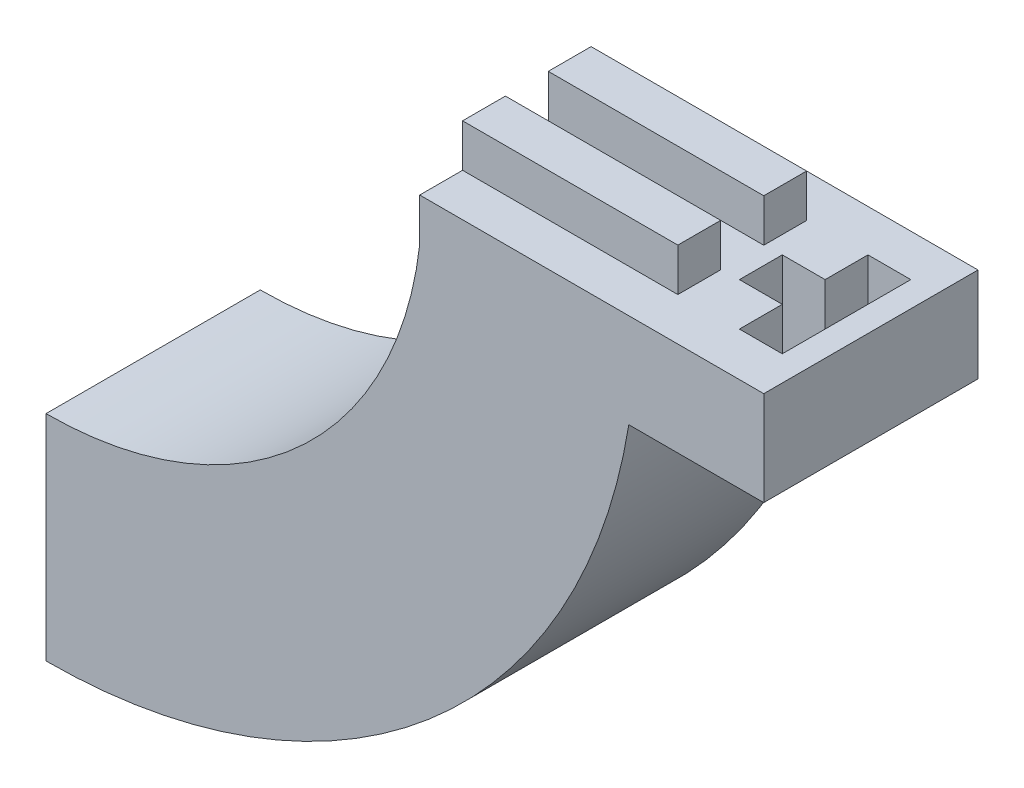
ISO-10303-21;
HEADER;
FILE_DESCRIPTION(('STEP AP214'),'2;1');
FILE_NAME('part.step','',(''),(''),'','','');
FILE_SCHEMA(('AUTOMOTIVE_DESIGN { 1 0 10303 214 1 1 1 1 }'));
ENDSEC;
DATA;
#1=APPLICATION_CONTEXT('core data for automotive mechanical design processes');
#2=APPLICATION_PROTOCOL_DEFINITION('international standard','automotive_design',2000,#1);
#3=PRODUCT_CONTEXT('',#1,'mechanical');
#4=PRODUCT('Part','Part','',(#3));
#5=PRODUCT_RELATED_PRODUCT_CATEGORY('part','',(#4));
#6=PRODUCT_DEFINITION_FORMATION('','',#4);
#7=PRODUCT_DEFINITION_CONTEXT('part definition',#1,'design');
#8=PRODUCT_DEFINITION('design','',#6,#7);
#9=PRODUCT_DEFINITION_SHAPE('','',#8);
#10=(LENGTH_UNIT() NAMED_UNIT(*) SI_UNIT(.MILLI.,.METRE.));
#11=(NAMED_UNIT(*) PLANE_ANGLE_UNIT() SI_UNIT($,.RADIAN.));
#12=(NAMED_UNIT(*) SI_UNIT($,.STERADIAN.) SOLID_ANGLE_UNIT());
#13=UNCERTAINTY_MEASURE_WITH_UNIT(LENGTH_MEASURE(1.E-05),#10,'distance_accuracy_value','');
#14=(GEOMETRIC_REPRESENTATION_CONTEXT(3) GLOBAL_UNCERTAINTY_ASSIGNED_CONTEXT((#13)) GLOBAL_UNIT_ASSIGNED_CONTEXT((#10,
#11,#12)) REPRESENTATION_CONTEXT('',''));
#15=CARTESIAN_POINT('',(0.,0.,0.));
#16=DIRECTION('',(0.,0.,1.));
#17=DIRECTION('',(1.,0.,0.));
#18=AXIS2_PLACEMENT_3D('',#15,#16,#17);
#19=CARTESIAN_POINT('',(0.,0.,0.));
#20=DIRECTION('',(0.,-1.,0.));
#21=DIRECTION('',(0.,0.,-1.));
#22=AXIS2_PLACEMENT_3D('',#19,#20,#21);
#23=PLANE('',#22);
#24=DIRECTION('',(-1.,0.,0.));
#25=VECTOR('',#24,1.);
#26=CARTESIAN_POINT('',(22.1548730531231,0.,0.));
#27=LINE('',#26,#25);
#28=CARTESIAN_POINT('',(42.5505771587127,0.,0.));
#29=VERTEX_POINT('',#28);
#30=CARTESIAN_POINT('',(22.1548730531231,0.,0.));
#31=VERTEX_POINT('',#30);
#32=EDGE_CURVE('E345',#29,#31,#27,.T.);
#33=ORIENTED_EDGE('',*,*,#32,.T.);
#34=DIRECTION('',(0.,0.,1.));
#35=VECTOR('',#34,1.);
#36=CARTESIAN_POINT('',(22.1548730531231,0.,0.));
#37=LINE('',#36,#35);
#38=CARTESIAN_POINT('',(22.1548730531231,0.,2.54));
#39=VERTEX_POINT('',#38);
#40=EDGE_CURVE('E348',#31,#39,#37,.T.);
#41=ORIENTED_EDGE('',*,*,#40,.T.);
#42=DIRECTION('',(-1.,0.,0.));
#43=VECTOR('',#42,1.);
#44=CARTESIAN_POINT('',(22.1548730531231,0.,2.54));
#45=LINE('',#44,#43);
#46=CARTESIAN_POINT('',(34.9305771587127,0.,2.54));
#47=VERTEX_POINT('',#46);
#48=EDGE_CURVE('E320',#47,#39,#45,.T.);
#49=ORIENTED_EDGE('',*,*,#48,.F.);
#50=DIRECTION('',(0.,0.,1.));
#51=VECTOR('',#50,1.);
#52=CARTESIAN_POINT('',(34.9305771587127,0.,12.7));
#53=LINE('',#52,#51);
#54=CARTESIAN_POINT('',(34.9305771587127,0.,5.07999999999999));
#55=VERTEX_POINT('',#54);
#56=EDGE_CURVE('E12',#47,#55,#53,.T.);
#57=ORIENTED_EDGE('',*,*,#56,.T.);
#58=DIRECTION('',(1.,0.,0.));
#59=VECTOR('',#58,1.);
#60=CARTESIAN_POINT('',(22.1548730531231,0.,5.08));
#61=LINE('',#60,#59);
#62=CARTESIAN_POINT('',(22.1548730531231,0.,5.08));
#63=VERTEX_POINT('',#62);
#64=EDGE_CURVE('E325',#63,#55,#61,.T.);
#65=ORIENTED_EDGE('',*,*,#64,.F.);
#66=CARTESIAN_POINT('',(22.1548730531231,0.,7.61999999999999));
#67=VERTEX_POINT('',#66);
#68=EDGE_CURVE('E352',#63,#67,#37,.T.);
#69=ORIENTED_EDGE('',*,*,#68,.T.);
#70=DIRECTION('',(-1.,0.,0.));
#71=VECTOR('',#70,1.);
#72=CARTESIAN_POINT('',(22.1548730531231,0.,7.62));
#73=LINE('',#72,#71);
#74=CARTESIAN_POINT('',(34.9162849444304,0.,7.61999999999999));
#75=VERTEX_POINT('',#74);
#76=EDGE_CURVE('E292',#75,#67,#73,.T.);
#77=ORIENTED_EDGE('',*,*,#76,.F.);
#78=DIRECTION('',(0.,0.,-1.));
#79=VECTOR('',#78,1.);
#80=CARTESIAN_POINT('',(34.9162849444304,0.,7.61999999999999));
#81=LINE('',#80,#79);
#82=CARTESIAN_POINT('',(34.9162849444304,0.,10.16));
#83=VERTEX_POINT('',#82);
#84=EDGE_CURVE('E297',#83,#75,#81,.T.);
#85=ORIENTED_EDGE('',*,*,#84,.F.);
#86=DIRECTION('',(1.,0.,0.));
#87=VECTOR('',#86,1.);
#88=CARTESIAN_POINT('',(22.1548730531231,0.,10.16));
#89=LINE('',#88,#87);
#90=CARTESIAN_POINT('',(22.1548730531231,0.,10.16));
#91=VERTEX_POINT('',#90);
#92=EDGE_CURVE('E305',#91,#83,#89,.T.);
#93=ORIENTED_EDGE('',*,*,#92,.F.);
#94=CARTESIAN_POINT('',(22.1548730531231,0.,12.7));
#95=VERTEX_POINT('',#94);
#96=EDGE_CURVE('E347',#91,#95,#37,.T.);
#97=ORIENTED_EDGE('',*,*,#96,.T.);
#98=DIRECTION('',(1.,0.,0.));
#99=VECTOR('',#98,1.);
#100=CARTESIAN_POINT('',(22.1548730531231,0.,12.7));
#101=LINE('',#100,#99);
#102=CARTESIAN_POINT('',(42.5505771587126,0.,12.7));
#103=VERTEX_POINT('',#102);
#104=EDGE_CURVE('E351',#95,#103,#101,.T.);
#105=ORIENTED_EDGE('',*,*,#104,.T.);
#106=DIRECTION('',(0.,0.,1.));
#107=VECTOR('',#106,1.);
#108=CARTESIAN_POINT('',(42.5505771587126,0.,12.7));
#109=LINE('',#108,#107);
#110=EDGE_CURVE('E285',#29,#103,#109,.T.);
#111=ORIENTED_EDGE('',*,*,#110,.F.);
#112=EDGE_LOOP('',(#33,#41,#49,#57,#65,#69,#77,#85,#93,#97,#105,#111));
#113=FACE_BOUND('',#112,.T.);
#114=DIRECTION('',(0.,0.,-1.));
#115=VECTOR('',#114,1.);
#116=CARTESIAN_POINT('',(41.0537290610981,0.,-2.86676657813493E-13));
#117=LINE('',#116,#115);
#118=CARTESIAN_POINT('',(41.0537290610982,0.,10.1063948567496));
#119=VERTEX_POINT('',#118);
#120=CARTESIAN_POINT('',(41.0537290610981,0.,2.48639485674955));
#121=VERTEX_POINT('',#120);
#122=EDGE_CURVE('E268',#119,#121,#117,.T.);
#123=ORIENTED_EDGE('',*,*,#122,.F.);
#124=DIRECTION('',(-1.,0.,0.));
#125=VECTOR('',#124,1.);
#126=CARTESIAN_POINT('',(0.,0.,10.1063948567498));
#127=LINE('',#126,#125);
#128=CARTESIAN_POINT('',(38.5137290610982,0.,10.1063948567496));
#129=VERTEX_POINT('',#128);
#130=EDGE_CURVE('E262',#119,#129,#127,.T.);
#131=ORIENTED_EDGE('',*,*,#130,.T.);
#132=DIRECTION('',(0.,0.,1.));
#133=VECTOR('',#132,1.);
#134=CARTESIAN_POINT('',(38.5137290610981,0.,-2.68939932612169E-13));
#135=LINE('',#134,#133);
#136=CARTESIAN_POINT('',(38.5137290610982,0.,7.56639485674957));
#137=VERTEX_POINT('',#136);
#138=EDGE_CURVE('E272',#137,#129,#135,.T.);
#139=ORIENTED_EDGE('',*,*,#138,.F.);
#140=DIRECTION('',(1.,0.,0.));
#141=VECTOR('',#140,1.);
#142=CARTESIAN_POINT('',(0.,0.,7.56639485674984));
#143=LINE('',#142,#141);
#144=CARTESIAN_POINT('',(35.9737290610982,0.,7.56639485674959));
#145=VERTEX_POINT('',#144);
#146=EDGE_CURVE('E260',#145,#137,#143,.T.);
#147=ORIENTED_EDGE('',*,*,#146,.F.);
#148=DIRECTION('',(0.,0.,-1.));
#149=VECTOR('',#148,1.);
#150=CARTESIAN_POINT('',(35.9737290610981,0.,-2.51203207410846E-13));
#151=LINE('',#150,#149);
#152=CARTESIAN_POINT('',(35.9737290610981,0.,5.02639485674959));
#153=VERTEX_POINT('',#152);
#154=EDGE_CURVE('E257',#145,#153,#151,.T.);
#155=ORIENTED_EDGE('',*,*,#154,.T.);
#156=DIRECTION('',(-1.,0.,0.));
#157=VECTOR('',#156,1.);
#158=CARTESIAN_POINT('',(0.,0.,5.02639485674984));
#159=LINE('',#158,#157);
#160=CARTESIAN_POINT('',(38.5137290610981,0.,5.02639485674957));
#161=VERTEX_POINT('',#160);
#162=EDGE_CURVE('E217',#161,#153,#159,.T.);
#163=ORIENTED_EDGE('',*,*,#162,.F.);
#164=DIRECTION('',(0.,0.,1.));
#165=VECTOR('',#164,1.);
#166=CARTESIAN_POINT('',(38.5137290610981,0.,-2.68939932612169E-13));
#167=LINE('',#166,#165);
#168=CARTESIAN_POINT('',(38.5137290610981,0.,2.48639485674957));
#169=VERTEX_POINT('',#168);
#170=EDGE_CURVE('E270',#169,#161,#167,.T.);
#171=ORIENTED_EDGE('',*,*,#170,.F.);
#172=DIRECTION('',(1.,0.,0.));
#173=VECTOR('',#172,1.);
#174=CARTESIAN_POINT('',(0.,0.,2.48639485674984));
#175=LINE('',#174,#173);
#176=EDGE_CURVE('E265',#169,#121,#175,.T.);
#177=ORIENTED_EDGE('',*,*,#176,.T.);
#178=EDGE_LOOP('',(#123,#131,#139,#147,#155,#163,#171,#177));
#179=FACE_BOUND('',#178,.T.);
#180=ADVANCED_FACE('F57',(#113,#179),#23,.F.);
#181=CARTESIAN_POINT('',(34.9305771587127,0.,0.));
#182=DIRECTION('',(-1.,0.,0.));
#183=DIRECTION('',(0.,0.,1.));
#184=AXIS2_PLACEMENT_3D('',#181,#182,#183);
#185=PLANE('',#184);
#186=ORIENTED_EDGE('',*,*,#56,.F.);
#187=DIRECTION('',(0.,-1.,0.));
#188=VECTOR('',#187,1.);
#189=CARTESIAN_POINT('',(34.9305771587127,2.54,2.54));
#190=LINE('',#189,#188);
#191=CARTESIAN_POINT('',(34.9305771587127,2.54,2.54));
#192=VERTEX_POINT('',#191);
#193=EDGE_CURVE('E331',#192,#47,#190,.T.);
#194=ORIENTED_EDGE('',*,*,#193,.F.);
#195=DIRECTION('',(0.,0.,-1.));
#196=VECTOR('',#195,1.);
#197=CARTESIAN_POINT('',(34.9305771587127,2.54,2.54));
#198=LINE('',#197,#196);
#199=CARTESIAN_POINT('',(34.9305771587127,2.54,5.07999999999999));
#200=VERTEX_POINT('',#199);
#201=EDGE_CURVE('E329',#200,#192,#198,.T.);
#202=ORIENTED_EDGE('',*,*,#201,.F.);
#203=DIRECTION('',(0.,-1.,0.));
#204=VECTOR('',#203,1.);
#205=CARTESIAN_POINT('',(34.9305771587127,2.54,5.07999999999999));
#206=LINE('',#205,#204);
#207=EDGE_CURVE('E336',#200,#55,#206,.T.);
#208=ORIENTED_EDGE('',*,*,#207,.T.);
#209=EDGE_LOOP('',(#186,#194,#202,#208));
#210=FACE_BOUND('',#209,.T.);
#211=ADVANCED_FACE('F454',(#210),#185,.F.);
#212=CARTESIAN_POINT('',(0.,0.,12.7));
#213=DIRECTION('',(0.,0.,-1.));
#214=DIRECTION('',(-1.,0.,0.));
#215=AXIS2_PLACEMENT_3D('',#212,#213,#214);
#216=CYLINDRICAL_SURFACE('',#215,35.);
#217=CARTESIAN_POINT('',(0.,0.,0.));
#218=DIRECTION('',(0.,0.,1.));
#219=DIRECTION('',(1.,0.,0.));
#220=AXIS2_PLACEMENT_3D('',#217,#218,#219);
#221=CIRCLE('',#220,35.);
#222=CARTESIAN_POINT('',(0.,-35.,0.));
#223=VERTEX_POINT('',#222);
#224=CARTESIAN_POINT('',(34.5500291498668,-5.59423683296936,0.));
#225=VERTEX_POINT('',#224);
#226=EDGE_CURVE('E370',#223,#225,#221,.T.);
#227=ORIENTED_EDGE('',*,*,#226,.T.);
#228=DIRECTION('',(0.,0.,-1.));
#229=VECTOR('',#228,1.);
#230=CARTESIAN_POINT('',(34.5500291498668,-5.59423683296936,12.7));
#231=LINE('',#230,#229);
#232=CARTESIAN_POINT('',(34.5500291498668,-5.59423683296936,12.7));
#233=VERTEX_POINT('',#232);
#234=EDGE_CURVE('E274',#225,#233,#231,.F.);
#235=ORIENTED_EDGE('',*,*,#234,.T.);
#236=CARTESIAN_POINT('',(0.,0.,12.7));
#237=DIRECTION('',(0.,0.,1.));
#238=DIRECTION('',(1.,0.,0.));
#239=AXIS2_PLACEMENT_3D('',#236,#237,#238);
#240=CIRCLE('',#239,35.);
#241=CARTESIAN_POINT('',(0.,-35.,12.7));
#242=VERTEX_POINT('',#241);
#243=EDGE_CURVE('E373',#242,#233,#240,.T.);
#244=ORIENTED_EDGE('',*,*,#243,.F.);
#245=DIRECTION('',(0.,0.,-1.));
#246=VECTOR('',#245,1.);
#247=CARTESIAN_POINT('',(0.,-35.,12.7));
#248=LINE('',#247,#246);
#249=EDGE_CURVE('E362',#223,#242,#248,.F.);
#250=ORIENTED_EDGE('',*,*,#249,.F.);
#251=EDGE_LOOP('',(#227,#235,#244,#250));
#252=FACE_BOUND('',#251,.T.);
#253=ADVANCED_FACE('F59',(#252),#216,.T.);
#254=CARTESIAN_POINT('',(0.,0.,12.7));
#255=DIRECTION('',(0.,0.,-1.));
#256=DIRECTION('',(-1.,0.,0.));
#257=AXIS2_PLACEMENT_3D('',#254,#255,#256);
#258=CYLINDRICAL_SURFACE('',#257,22.3);
#259=CARTESIAN_POINT('',(0.,0.,0.));
#260=DIRECTION('',(0.,0.,1.));
#261=DIRECTION('',(1.,0.,0.));
#262=AXIS2_PLACEMENT_3D('',#259,#260,#261);
#263=CIRCLE('',#262,22.3);
#264=CARTESIAN_POINT('',(0.,-22.3,0.));
#265=VERTEX_POINT('',#264);
#266=CARTESIAN_POINT('',(22.1548730531231,-2.54,0.));
#267=VERTEX_POINT('',#266);
#268=EDGE_CURVE('E366',#265,#267,#263,.T.);
#269=ORIENTED_EDGE('',*,*,#268,.F.);
#270=DIRECTION('',(0.,0.,-1.));
#271=VECTOR('',#270,1.);
#272=CARTESIAN_POINT('',(0.,-22.3,12.7));
#273=LINE('',#272,#271);
#274=CARTESIAN_POINT('',(0.,-22.3,12.7));
#275=VERTEX_POINT('',#274);
#276=EDGE_CURVE('E61',#265,#275,#273,.F.);
#277=ORIENTED_EDGE('',*,*,#276,.T.);
#278=CARTESIAN_POINT('',(0.,0.,12.7));
#279=DIRECTION('',(0.,0.,1.));
#280=DIRECTION('',(1.,0.,0.));
#281=AXIS2_PLACEMENT_3D('',#278,#279,#280);
#282=CIRCLE('',#281,22.3);
#283=CARTESIAN_POINT('',(22.1548730531231,-2.54,12.7));
#284=VERTEX_POINT('',#283);
#285=EDGE_CURVE('E367',#275,#284,#282,.T.);
#286=ORIENTED_EDGE('',*,*,#285,.T.);
#287=DIRECTION('',(0.,0.,-1.));
#288=VECTOR('',#287,1.);
#289=CARTESIAN_POINT('',(22.1548730531231,-2.54,12.7));
#290=LINE('',#289,#288);
#291=EDGE_CURVE('E376',#267,#284,#290,.F.);
#292=ORIENTED_EDGE('',*,*,#291,.F.);
#293=EDGE_LOOP('',(#269,#277,#286,#292));
#294=FACE_BOUND('',#293,.T.);
#295=ADVANCED_FACE('F385',(#294),#258,.F.);
#296=CARTESIAN_POINT('',(0.,0.,0.));
#297=DIRECTION('',(0.,0.,1.));
#298=DIRECTION('',(1.,0.,0.));
#299=AXIS2_PLACEMENT_3D('',#296,#297,#298);
#300=PLANE('',#299);
#301=DIRECTION('',(-1.,0.,0.));
#302=VECTOR('',#301,1.);
#303=CARTESIAN_POINT('',(42.5505771587127,-5.59423683296936,0.));
#304=LINE('',#303,#302);
#305=CARTESIAN_POINT('',(42.5505771587127,-5.59423683296936,0.));
#306=VERTEX_POINT('',#305);
#307=EDGE_CURVE('E287',#306,#225,#304,.T.);
#308=ORIENTED_EDGE('',*,*,#307,.T.);
#309=ORIENTED_EDGE('',*,*,#226,.F.);
#310=DIRECTION('',(0.,-1.,0.));
#311=VECTOR('',#310,1.);
#312=CARTESIAN_POINT('',(0.,36.9387780648521,0.));
#313=LINE('',#312,#311);
#314=EDGE_CURVE('E360',#265,#223,#313,.T.);
#315=ORIENTED_EDGE('',*,*,#314,.F.);
#316=ORIENTED_EDGE('',*,*,#268,.T.);
#317=DIRECTION('',(0.,-1.,0.));
#318=VECTOR('',#317,1.);
#319=CARTESIAN_POINT('',(22.1548730531231,0.,0.));
#320=LINE('',#319,#318);
#321=EDGE_CURVE('E357',#31,#267,#320,.T.);
#322=ORIENTED_EDGE('',*,*,#321,.F.);
#323=ORIENTED_EDGE('',*,*,#32,.F.);
#324=DIRECTION('',(0.,1.,0.));
#325=VECTOR('',#324,1.);
#326=CARTESIAN_POINT('',(42.5505771587127,0.,0.));
#327=LINE('',#326,#325);
#328=EDGE_CURVE('E282',#306,#29,#327,.T.);
#329=ORIENTED_EDGE('',*,*,#328,.F.);
#330=EDGE_LOOP('',(#308,#309,#315,#316,#322,#323,#329));
#331=FACE_BOUND('',#330,.T.);
#332=ADVANCED_FACE('F431',(#331),#300,.F.);
#333=CARTESIAN_POINT('',(0.,0.,12.7));
#334=DIRECTION('',(0.,0.,1.));
#335=DIRECTION('',(1.,0.,0.));
#336=AXIS2_PLACEMENT_3D('',#333,#334,#335);
#337=PLANE('',#336);
#338=ORIENTED_EDGE('',*,*,#243,.T.);
#339=DIRECTION('',(-1.,0.,0.));
#340=VECTOR('',#339,1.);
#341=CARTESIAN_POINT('',(42.5505771587126,-5.59423683296936,12.7));
#342=LINE('',#341,#340);
#343=CARTESIAN_POINT('',(42.5505771587126,-5.59423683296936,12.7));
#344=VERTEX_POINT('',#343);
#345=EDGE_CURVE('E290',#344,#233,#342,.T.);
#346=ORIENTED_EDGE('',*,*,#345,.F.);
#347=DIRECTION('',(0.,-1.,0.));
#348=VECTOR('',#347,1.);
#349=CARTESIAN_POINT('',(42.5505771587126,0.,12.7));
#350=LINE('',#349,#348);
#351=EDGE_CURVE('E277',#103,#344,#350,.T.);
#352=ORIENTED_EDGE('',*,*,#351,.F.);
#353=ORIENTED_EDGE('',*,*,#104,.F.);
#354=DIRECTION('',(0.,-1.,0.));
#355=VECTOR('',#354,1.);
#356=CARTESIAN_POINT('',(22.1548730531231,0.,12.7));
#357=LINE('',#356,#355);
#358=EDGE_CURVE('E354',#95,#284,#357,.T.);
#359=ORIENTED_EDGE('',*,*,#358,.T.);
#360=ORIENTED_EDGE('',*,*,#285,.F.);
#361=DIRECTION('',(0.,-1.,0.));
#362=VECTOR('',#361,1.);
#363=CARTESIAN_POINT('',(0.,36.9387780648521,12.7));
#364=LINE('',#363,#362);
#365=EDGE_CURVE('E359',#275,#242,#364,.T.);
#366=ORIENTED_EDGE('',*,*,#365,.T.);
#367=EDGE_LOOP('',(#338,#346,#352,#353,#359,#360,#366));
#368=FACE_BOUND('',#367,.T.);
#369=ADVANCED_FACE('F389',(#368),#337,.T.);
#370=CARTESIAN_POINT('',(0.,36.9387780648521,0.));
#371=DIRECTION('',(-1.,0.,0.));
#372=DIRECTION('',(0.,0.,1.));
#373=AXIS2_PLACEMENT_3D('',#370,#371,#372);
#374=PLANE('',#373);
#375=ORIENTED_EDGE('',*,*,#249,.T.);
#376=ORIENTED_EDGE('',*,*,#365,.F.);
#377=ORIENTED_EDGE('',*,*,#276,.F.);
#378=ORIENTED_EDGE('',*,*,#314,.T.);
#379=EDGE_LOOP('',(#375,#376,#377,#378));
#380=FACE_BOUND('',#379,.T.);
#381=ADVANCED_FACE('F435',(#380),#374,.T.);
#382=CARTESIAN_POINT('',(22.1548730531231,0.,0.));
#383=DIRECTION('',(1.,0.,0.));
#384=DIRECTION('',(0.,0.,-1.));
#385=AXIS2_PLACEMENT_3D('',#382,#383,#384);
#386=PLANE('',#385);
#387=ORIENTED_EDGE('',*,*,#291,.T.);
#388=ORIENTED_EDGE('',*,*,#358,.F.);
#389=ORIENTED_EDGE('',*,*,#96,.F.);
#390=DIRECTION('',(0.,-1.,0.));
#391=VECTOR('',#390,1.);
#392=CARTESIAN_POINT('',(22.1548730531231,2.54,10.16));
#393=LINE('',#392,#391);
#394=CARTESIAN_POINT('',(22.1548730531231,2.54,10.16));
#395=VERTEX_POINT('',#394);
#396=EDGE_CURVE('E314',#395,#91,#393,.T.);
#397=ORIENTED_EDGE('',*,*,#396,.F.);
#398=DIRECTION('',(0.,0.,1.));
#399=VECTOR('',#398,1.);
#400=CARTESIAN_POINT('',(22.1548730531231,2.54,7.62));
#401=LINE('',#400,#399);
#402=CARTESIAN_POINT('',(22.1548730531231,2.54,7.62));
#403=VERTEX_POINT('',#402);
#404=EDGE_CURVE('E296',#403,#395,#401,.T.);
#405=ORIENTED_EDGE('',*,*,#404,.F.);
#406=DIRECTION('',(0.,-1.,0.));
#407=VECTOR('',#406,1.);
#408=CARTESIAN_POINT('',(22.1548730531231,2.54,7.62));
#409=LINE('',#408,#407);
#410=EDGE_CURVE('E317',#403,#67,#409,.T.);
#411=ORIENTED_EDGE('',*,*,#410,.T.);
#412=ORIENTED_EDGE('',*,*,#68,.F.);
#413=DIRECTION('',(0.,-1.,0.));
#414=VECTOR('',#413,1.);
#415=CARTESIAN_POINT('',(22.1548730531231,2.54,5.08));
#416=LINE('',#415,#414);
#417=CARTESIAN_POINT('',(22.1548730531231,2.54,5.08));
#418=VERTEX_POINT('',#417);
#419=EDGE_CURVE('E339',#418,#63,#416,.T.);
#420=ORIENTED_EDGE('',*,*,#419,.F.);
#421=DIRECTION('',(0.,0.,1.));
#422=VECTOR('',#421,1.);
#423=CARTESIAN_POINT('',(22.1548730531231,2.54,2.54));
#424=LINE('',#423,#422);
#425=CARTESIAN_POINT('',(22.1548730531231,2.54,2.54));
#426=VERTEX_POINT('',#425);
#427=EDGE_CURVE('E324',#426,#418,#424,.T.);
#428=ORIENTED_EDGE('',*,*,#427,.F.);
#429=DIRECTION('',(0.,-1.,0.));
#430=VECTOR('',#429,1.);
#431=CARTESIAN_POINT('',(22.1548730531231,2.54,2.54));
#432=LINE('',#431,#430);
#433=EDGE_CURVE('E342',#426,#39,#432,.T.);
#434=ORIENTED_EDGE('',*,*,#433,.T.);
#435=ORIENTED_EDGE('',*,*,#40,.F.);
#436=ORIENTED_EDGE('',*,*,#321,.T.);
#437=EDGE_LOOP('',(#387,#388,#389,#397,#405,#411,#412,#420,#428,#434,#435,#436));
#438=FACE_BOUND('',#437,.T.);
#439=ADVANCED_FACE('F393',(#438),#386,.F.);
#440=CARTESIAN_POINT('',(22.1548730531231,2.54,2.54));
#441=DIRECTION('',(0.,0.,1.));
#442=DIRECTION('',(1.,0.,0.));
#443=AXIS2_PLACEMENT_3D('',#440,#441,#442);
#444=PLANE('',#443);
#445=ORIENTED_EDGE('',*,*,#48,.T.);
#446=ORIENTED_EDGE('',*,*,#433,.F.);
#447=DIRECTION('',(-1.,0.,0.));
#448=VECTOR('',#447,1.);
#449=CARTESIAN_POINT('',(22.1548730531231,2.54,2.54));
#450=LINE('',#449,#448);
#451=EDGE_CURVE('E321',#192,#426,#450,.T.);
#452=ORIENTED_EDGE('',*,*,#451,.F.);
#453=ORIENTED_EDGE('',*,*,#193,.T.);
#454=EDGE_LOOP('',(#445,#446,#452,#453));
#455=FACE_BOUND('',#454,.T.);
#456=ADVANCED_FACE('F427',(#455),#444,.F.);
#457=CARTESIAN_POINT('',(22.1548730531231,2.54,5.08));
#458=DIRECTION('',(0.,0.,-1.));
#459=DIRECTION('',(-1.,0.,0.));
#460=AXIS2_PLACEMENT_3D('',#457,#458,#459);
#461=PLANE('',#460);
#462=ORIENTED_EDGE('',*,*,#64,.T.);
#463=ORIENTED_EDGE('',*,*,#207,.F.);
#464=DIRECTION('',(1.,0.,0.));
#465=VECTOR('',#464,1.);
#466=CARTESIAN_POINT('',(22.1548730531231,2.54,5.08));
#467=LINE('',#466,#465);
#468=EDGE_CURVE('E327',#418,#200,#467,.T.);
#469=ORIENTED_EDGE('',*,*,#468,.F.);
#470=ORIENTED_EDGE('',*,*,#419,.T.);
#471=EDGE_LOOP('',(#462,#463,#469,#470));
#472=FACE_BOUND('',#471,.T.);
#473=ADVANCED_FACE('F417',(#472),#461,.F.);
#474=CARTESIAN_POINT('',(0.,2.54,0.));
#475=DIRECTION('',(0.,-1.,0.));
#476=DIRECTION('',(0.,0.,-1.));
#477=AXIS2_PLACEMENT_3D('',#474,#475,#476);
#478=PLANE('',#477);
#479=ORIENTED_EDGE('',*,*,#451,.T.);
#480=ORIENTED_EDGE('',*,*,#427,.T.);
#481=ORIENTED_EDGE('',*,*,#468,.T.);
#482=ORIENTED_EDGE('',*,*,#201,.T.);
#483=EDGE_LOOP('',(#479,#480,#481,#482));
#484=FACE_BOUND('',#483,.T.);
#485=ADVANCED_FACE('F424',(#484),#478,.F.);
#486=CARTESIAN_POINT('',(22.1548730531231,2.54,7.62));
#487=DIRECTION('',(0.,0.,1.));
#488=DIRECTION('',(1.,0.,0.));
#489=AXIS2_PLACEMENT_3D('',#486,#487,#488);
#490=PLANE('',#489);
#491=ORIENTED_EDGE('',*,*,#76,.T.);
#492=ORIENTED_EDGE('',*,*,#410,.F.);
#493=DIRECTION('',(-1.,0.,0.));
#494=VECTOR('',#493,1.);
#495=CARTESIAN_POINT('',(22.1548730531231,2.54,7.62));
#496=LINE('',#495,#494);
#497=CARTESIAN_POINT('',(34.9162849444304,2.54,7.61999999999999));
#498=VERTEX_POINT('',#497);
#499=EDGE_CURVE('E293',#498,#403,#496,.T.);
#500=ORIENTED_EDGE('',*,*,#499,.F.);
#501=DIRECTION('',(0.,-1.,0.));
#502=VECTOR('',#501,1.);
#503=CARTESIAN_POINT('',(34.9162849444304,2.54,7.61999999999999));
#504=LINE('',#503,#502);
#505=EDGE_CURVE('E303',#498,#75,#504,.T.);
#506=ORIENTED_EDGE('',*,*,#505,.T.);
#507=EDGE_LOOP('',(#491,#492,#500,#506));
#508=FACE_BOUND('',#507,.T.);
#509=ADVANCED_FACE('F413',(#508),#490,.F.);
#510=CARTESIAN_POINT('',(22.1548730531231,2.54,10.16));
#511=DIRECTION('',(0.,0.,-1.));
#512=DIRECTION('',(-1.,0.,0.));
#513=AXIS2_PLACEMENT_3D('',#510,#511,#512);
#514=PLANE('',#513);
#515=ORIENTED_EDGE('',*,*,#92,.T.);
#516=DIRECTION('',(0.,-1.,0.));
#517=VECTOR('',#516,1.);
#518=CARTESIAN_POINT('',(34.9162849444304,2.54,10.16));
#519=LINE('',#518,#517);
#520=CARTESIAN_POINT('',(34.9162849444304,2.54,10.16));
#521=VERTEX_POINT('',#520);
#522=EDGE_CURVE('E311',#521,#83,#519,.T.);
#523=ORIENTED_EDGE('',*,*,#522,.F.);
#524=DIRECTION('',(1.,0.,0.));
#525=VECTOR('',#524,1.);
#526=CARTESIAN_POINT('',(22.1548730531231,2.54,10.16));
#527=LINE('',#526,#525);
#528=EDGE_CURVE('E299',#395,#521,#527,.T.);
#529=ORIENTED_EDGE('',*,*,#528,.F.);
#530=ORIENTED_EDGE('',*,*,#396,.T.);
#531=EDGE_LOOP('',(#515,#523,#529,#530));
#532=FACE_BOUND('',#531,.T.);
#533=ADVANCED_FACE('F402',(#532),#514,.F.);
#534=CARTESIAN_POINT('',(34.9162849444304,2.54,7.61999999999999));
#535=DIRECTION('',(-1.,0.,0.));
#536=DIRECTION('',(0.,0.,1.));
#537=AXIS2_PLACEMENT_3D('',#534,#535,#536);
#538=PLANE('',#537);
#539=ORIENTED_EDGE('',*,*,#84,.T.);
#540=ORIENTED_EDGE('',*,*,#505,.F.);
#541=DIRECTION('',(0.,0.,-1.));
#542=VECTOR('',#541,1.);
#543=CARTESIAN_POINT('',(34.9162849444304,2.54,7.61999999999999));
#544=LINE('',#543,#542);
#545=EDGE_CURVE('E301',#521,#498,#544,.T.);
#546=ORIENTED_EDGE('',*,*,#545,.F.);
#547=ORIENTED_EDGE('',*,*,#522,.T.);
#548=EDGE_LOOP('',(#539,#540,#546,#547));
#549=FACE_BOUND('',#548,.T.);
#550=ADVANCED_FACE('F519',(#549),#538,.F.);
#551=CARTESIAN_POINT('',(0.,2.54,0.));
#552=DIRECTION('',(0.,-1.,0.));
#553=DIRECTION('',(0.,0.,-1.));
#554=AXIS2_PLACEMENT_3D('',#551,#552,#553);
#555=PLANE('',#554);
#556=ORIENTED_EDGE('',*,*,#499,.T.);
#557=ORIENTED_EDGE('',*,*,#404,.T.);
#558=ORIENTED_EDGE('',*,*,#528,.T.);
#559=ORIENTED_EDGE('',*,*,#545,.T.);
#560=EDGE_LOOP('',(#556,#557,#558,#559));
#561=FACE_BOUND('',#560,.T.);
#562=ADVANCED_FACE('F405',(#561),#555,.F.);
#563=CARTESIAN_POINT('',(42.5505771587126,-5.59423683296936,12.7));
#564=DIRECTION('',(0.,1.,0.));
#565=DIRECTION('',(0.,0.,1.));
#566=AXIS2_PLACEMENT_3D('',#563,#564,#565);
#567=PLANE('',#566);
#568=DIRECTION('',(0.,0.,1.));
#569=VECTOR('',#568,1.);
#570=CARTESIAN_POINT('',(38.5137290610982,-5.59423683296978,12.6463948567496));
#571=LINE('',#570,#569);
#572=CARTESIAN_POINT('',(38.5137290610982,-5.59423683296978,7.56639485674957));
#573=VERTEX_POINT('',#572);
#574=CARTESIAN_POINT('',(38.5137290610982,-5.59423683296978,10.1063948567496));
#575=VERTEX_POINT('',#574);
#576=EDGE_CURVE('E252',#573,#575,#571,.T.);
#577=ORIENTED_EDGE('',*,*,#576,.T.);
#578=DIRECTION('',(1.,0.,0.));
#579=VECTOR('',#578,1.);
#580=CARTESIAN_POINT('',(38.5137290610982,-5.59423683296978,10.1063948567496));
#581=LINE('',#580,#579);
#582=CARTESIAN_POINT('',(41.0537290610982,-5.59423683296978,10.1063948567496));
#583=VERTEX_POINT('',#582);
#584=EDGE_CURVE('E233',#575,#583,#581,.T.);
#585=ORIENTED_EDGE('',*,*,#584,.T.);
#586=DIRECTION('',(0.,0.,-1.));
#587=VECTOR('',#586,1.);
#588=CARTESIAN_POINT('',(41.0537290610982,-5.59423683296978,12.6463948567496));
#589=LINE('',#588,#587);
#590=CARTESIAN_POINT('',(41.0537290610981,-5.59423683296978,2.48639485674956));
#591=VERTEX_POINT('',#590);
#592=EDGE_CURVE('E254',#583,#591,#589,.T.);
#593=ORIENTED_EDGE('',*,*,#592,.T.);
#594=DIRECTION('',(-1.,0.,0.));
#595=VECTOR('',#594,1.);
#596=CARTESIAN_POINT('',(38.5137290610981,-5.59423683296978,2.48639485674957));
#597=LINE('',#596,#595);
#598=CARTESIAN_POINT('',(38.5137290610981,-5.59423683296978,2.48639485674957));
#599=VERTEX_POINT('',#598);
#600=EDGE_CURVE('E247',#591,#599,#597,.T.);
#601=ORIENTED_EDGE('',*,*,#600,.T.);
#602=CARTESIAN_POINT('',(38.5137290610981,-5.59423683296978,5.02639485674957));
#603=VERTEX_POINT('',#602);
#604=EDGE_CURVE('E232',#599,#603,#571,.T.);
#605=ORIENTED_EDGE('',*,*,#604,.T.);
#606=DIRECTION('',(1.,0.,0.));
#607=VECTOR('',#606,1.);
#608=CARTESIAN_POINT('',(35.9737290610981,-5.59423683296978,5.02639485674959));
#609=LINE('',#608,#607);
#610=CARTESIAN_POINT('',(35.9737290610981,-5.59423683296978,5.02639485674959));
#611=VERTEX_POINT('',#610);
#612=EDGE_CURVE('E214',#611,#603,#609,.T.);
#613=ORIENTED_EDGE('',*,*,#612,.F.);
#614=DIRECTION('',(0.,0.,1.));
#615=VECTOR('',#614,1.);
#616=CARTESIAN_POINT('',(35.9737290610982,-5.59423683296978,7.56639485674959));
#617=LINE('',#616,#615);
#618=CARTESIAN_POINT('',(35.9737290610982,-5.59423683296936,7.56639485674959));
#619=VERTEX_POINT('',#618);
#620=EDGE_CURVE('E219',#611,#619,#617,.T.);
#621=ORIENTED_EDGE('',*,*,#620,.T.);
#622=DIRECTION('',(1.,0.,0.));
#623=VECTOR('',#622,1.);
#624=CARTESIAN_POINT('',(35.9737290610982,-5.59423683296978,7.56639485674959));
#625=LINE('',#624,#623);
#626=EDGE_CURVE('E225',#619,#573,#625,.T.);
#627=ORIENTED_EDGE('',*,*,#626,.T.);
#628=EDGE_LOOP('',(#577,#585,#593,#601,#605,#613,#621,#627));
#629=FACE_BOUND('',#628,.T.);
#630=ORIENTED_EDGE('',*,*,#345,.T.);
#631=ORIENTED_EDGE('',*,*,#234,.F.);
#632=ORIENTED_EDGE('',*,*,#307,.F.);
#633=DIRECTION('',(0.,0.,-1.));
#634=VECTOR('',#633,1.);
#635=CARTESIAN_POINT('',(42.5505771587126,-5.59423683296936,12.7));
#636=LINE('',#635,#634);
#637=EDGE_CURVE('E280',#344,#306,#636,.T.);
#638=ORIENTED_EDGE('',*,*,#637,.F.);
#639=EDGE_LOOP('',(#630,#631,#632,#638));
#640=FACE_BOUND('',#639,.T.);
#641=ADVANCED_FACE('F228',(#629,#640),#567,.F.);
#642=CARTESIAN_POINT('',(42.5505771587127,0.,0.));
#643=DIRECTION('',(1.,0.,0.));
#644=DIRECTION('',(0.,0.,-1.));
#645=AXIS2_PLACEMENT_3D('',#642,#643,#644);
#646=PLANE('',#645);
#647=ORIENTED_EDGE('',*,*,#351,.T.);
#648=ORIENTED_EDGE('',*,*,#637,.T.);
#649=ORIENTED_EDGE('',*,*,#328,.T.);
#650=ORIENTED_EDGE('',*,*,#110,.T.);
#651=EDGE_LOOP('',(#647,#648,#649,#650));
#652=FACE_BOUND('',#651,.T.);
#653=ADVANCED_FACE('F441',(#652),#646,.T.);
#654=CARTESIAN_POINT('',(38.5137290610982,32.5057631670302,12.6463948567496));
#655=DIRECTION('',(1.,0.,0.));
#656=DIRECTION('',(0.,-1.,0.));
#657=AXIS2_PLACEMENT_3D('',#654,#655,#656);
#658=PLANE('',#657);
#659=ORIENTED_EDGE('',*,*,#138,.T.);
#660=DIRECTION('',(0.,-1.,0.));
#661=VECTOR('',#660,1.);
#662=CARTESIAN_POINT('',(38.5137290610982,-5.59423683296978,10.1063948567496));
#663=LINE('',#662,#661);
#664=EDGE_CURVE('E243',#129,#575,#663,.T.);
#665=ORIENTED_EDGE('',*,*,#664,.T.);
#666=ORIENTED_EDGE('',*,*,#576,.F.);
#667=DIRECTION('',(0.,1.,0.));
#668=VECTOR('',#667,1.);
#669=CARTESIAN_POINT('',(38.5137290610982,-5.59423683296978,7.56639485674957));
#670=LINE('',#669,#668);
#671=EDGE_CURVE('E617',#573,#137,#670,.T.);
#672=ORIENTED_EDGE('',*,*,#671,.T.);
#673=EDGE_LOOP('',(#659,#665,#666,#672));
#674=FACE_BOUND('',#673,.T.);
#675=ADVANCED_FACE('F443',(#674),#658,.T.);
#676=ORIENTED_EDGE('',*,*,#170,.T.);
#677=DIRECTION('',(0.,-1.,0.));
#678=VECTOR('',#677,1.);
#679=CARTESIAN_POINT('',(38.5137290610981,-5.59423683296978,5.02639485674957));
#680=LINE('',#679,#678);
#681=EDGE_CURVE('E621',#161,#603,#680,.T.);
#682=ORIENTED_EDGE('',*,*,#681,.T.);
#683=ORIENTED_EDGE('',*,*,#604,.F.);
#684=DIRECTION('',(0.,1.,0.));
#685=VECTOR('',#684,1.);
#686=CARTESIAN_POINT('',(38.5137290610981,32.5057631670302,2.48639485674957));
#687=LINE('',#686,#685);
#688=EDGE_CURVE('E249',#599,#169,#687,.T.);
#689=ORIENTED_EDGE('',*,*,#688,.T.);
#690=EDGE_LOOP('',(#676,#682,#683,#689));
#691=FACE_BOUND('',#690,.T.);
#692=ADVANCED_FACE('F449',(#691),#658,.T.);
#693=CARTESIAN_POINT('',(41.0537290610982,32.5057631670302,12.6463948567496));
#694=DIRECTION('',(-1.,0.,0.));
#695=DIRECTION('',(0.,1.,0.));
#696=AXIS2_PLACEMENT_3D('',#693,#694,#695);
#697=PLANE('',#696);
#698=ORIENTED_EDGE('',*,*,#122,.T.);
#699=DIRECTION('',(0.,-1.,0.));
#700=VECTOR('',#699,1.);
#701=CARTESIAN_POINT('',(41.0537290610981,32.5057631670302,2.48639485674955));
#702=LINE('',#701,#700);
#703=EDGE_CURVE('E245',#121,#591,#702,.T.);
#704=ORIENTED_EDGE('',*,*,#703,.T.);
#705=ORIENTED_EDGE('',*,*,#592,.F.);
#706=DIRECTION('',(0.,1.,0.));
#707=VECTOR('',#706,1.);
#708=CARTESIAN_POINT('',(41.0537290610982,-5.59423683296978,10.1063948567496));
#709=LINE('',#708,#707);
#710=EDGE_CURVE('E236',#583,#119,#709,.T.);
#711=ORIENTED_EDGE('',*,*,#710,.T.);
#712=EDGE_LOOP('',(#698,#704,#705,#711));
#713=FACE_BOUND('',#712,.T.);
#714=ADVANCED_FACE('F556',(#713),#697,.T.);
#715=CARTESIAN_POINT('',(39.7837290610981,-5.59423683296978,2.48639485674956));
#716=DIRECTION('',(0.,0.,-1.));
#717=DIRECTION('',(0.,-1.,0.));
#718=AXIS2_PLACEMENT_3D('',#715,#716,#717);
#719=PLANE('',#718);
#720=ORIENTED_EDGE('',*,*,#688,.F.);
#721=ORIENTED_EDGE('',*,*,#600,.F.);
#722=ORIENTED_EDGE('',*,*,#703,.F.);
#723=ORIENTED_EDGE('',*,*,#176,.F.);
#724=EDGE_LOOP('',(#720,#721,#722,#723));
#725=FACE_BOUND('',#724,.T.);
#726=ADVANCED_FACE('F565',(#725),#719,.F.);
#727=CARTESIAN_POINT('',(39.7837290610982,-5.59423683296978,10.1063948567496));
#728=DIRECTION('',(0.,0.,1.));
#729=DIRECTION('',(0.,1.,0.));
#730=AXIS2_PLACEMENT_3D('',#727,#728,#729);
#731=PLANE('',#730);
#732=ORIENTED_EDGE('',*,*,#710,.F.);
#733=ORIENTED_EDGE('',*,*,#584,.F.);
#734=ORIENTED_EDGE('',*,*,#664,.F.);
#735=ORIENTED_EDGE('',*,*,#130,.F.);
#736=EDGE_LOOP('',(#732,#733,#734,#735));
#737=FACE_BOUND('',#736,.T.);
#738=ADVANCED_FACE('F575',(#737),#731,.F.);
#739=CARTESIAN_POINT('',(35.9737290610982,-5.59423683296978,7.56639485674959));
#740=DIRECTION('',(0.,0.,-1.));
#741=DIRECTION('',(0.,-1.,0.));
#742=AXIS2_PLACEMENT_3D('',#739,#740,#741);
#743=PLANE('',#742);
#744=ORIENTED_EDGE('',*,*,#146,.T.);
#745=ORIENTED_EDGE('',*,*,#671,.F.);
#746=ORIENTED_EDGE('',*,*,#626,.F.);
#747=DIRECTION('',(0.,1.,0.));
#748=VECTOR('',#747,1.);
#749=CARTESIAN_POINT('',(35.9737290610982,-5.59423683296978,7.56639485674959));
#750=LINE('',#749,#748);
#751=EDGE_CURVE('E78',#619,#145,#750,.T.);
#752=ORIENTED_EDGE('',*,*,#751,.T.);
#753=EDGE_LOOP('',(#744,#745,#746,#752));
#754=FACE_BOUND('',#753,.T.);
#755=ADVANCED_FACE('F585',(#754),#743,.T.);
#756=CARTESIAN_POINT('',(35.9737290610981,-5.59423683296978,5.02639485674959));
#757=DIRECTION('',(0.,0.,1.));
#758=DIRECTION('',(0.,1.,0.));
#759=AXIS2_PLACEMENT_3D('',#756,#757,#758);
#760=PLANE('',#759);
#761=ORIENTED_EDGE('',*,*,#162,.T.);
#762=DIRECTION('',(0.,-1.,0.));
#763=VECTOR('',#762,1.);
#764=CARTESIAN_POINT('',(35.9737290610981,-5.59423683296978,5.02639485674959));
#765=LINE('',#764,#763);
#766=EDGE_CURVE('E73',#153,#611,#765,.T.);
#767=ORIENTED_EDGE('',*,*,#766,.T.);
#768=ORIENTED_EDGE('',*,*,#612,.T.);
#769=ORIENTED_EDGE('',*,*,#681,.F.);
#770=EDGE_LOOP('',(#761,#767,#768,#769));
#771=FACE_BOUND('',#770,.T.);
#772=ADVANCED_FACE('F211',(#771),#760,.T.);
#773=CARTESIAN_POINT('',(35.9737290610981,-5.59423683296978,6.29639485674959));
#774=DIRECTION('',(-1.,0.,0.));
#775=DIRECTION('',(0.,1.,0.));
#776=AXIS2_PLACEMENT_3D('',#773,#774,#775);
#777=PLANE('',#776);
#778=ORIENTED_EDGE('',*,*,#751,.F.);
#779=ORIENTED_EDGE('',*,*,#620,.F.);
#780=ORIENTED_EDGE('',*,*,#766,.F.);
#781=ORIENTED_EDGE('',*,*,#154,.F.);
#782=EDGE_LOOP('',(#778,#779,#780,#781));
#783=FACE_BOUND('',#782,.T.);
#784=ADVANCED_FACE('F222',(#783),#777,.F.);
#785=CLOSED_SHELL('',(#180,#211,#253,#295,#332,#369,#381,#439,#456,#473,#485,#509,#533,#550,
#562,#641,#653,#675,#692,#714,#726,#738,#755,#772,#784));
#786=MANIFOLD_SOLID_BREP('B2',#785);
#787=ADVANCED_BREP_SHAPE_REPRESENTATION('',(#18,#786),#14);
#788=SHAPE_DEFINITION_REPRESENTATION(#9,#787);
ENDSEC;
END-ISO-10303-21;
